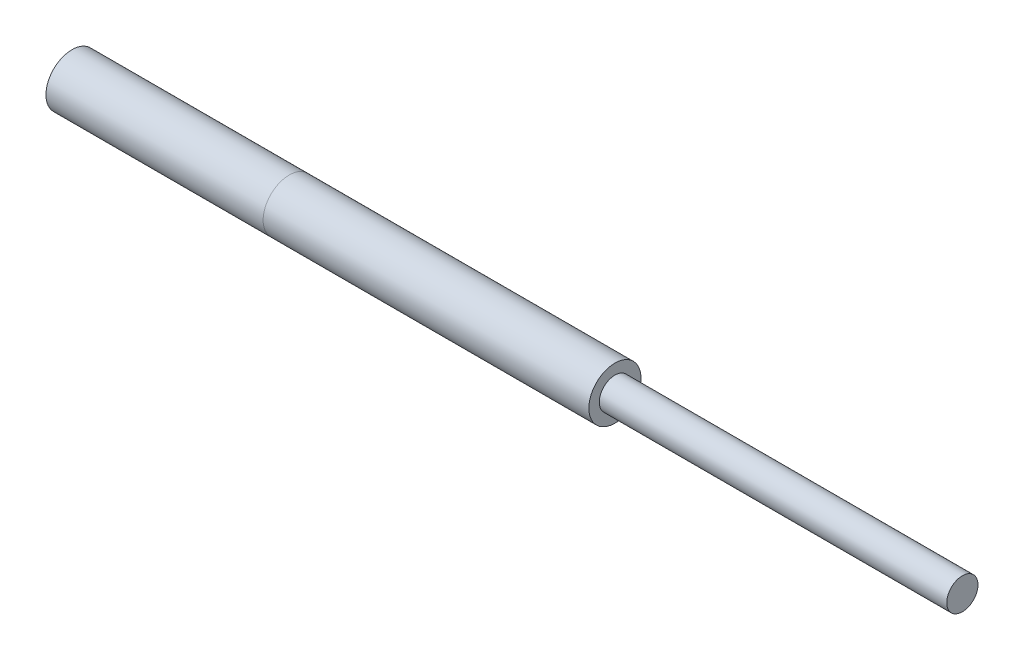
ISO-10303-21;
HEADER;
FILE_DESCRIPTION(('STEP AP214'),'2;1');
FILE_NAME('part.step','',(''),(''),'','','');
FILE_SCHEMA(('AUTOMOTIVE_DESIGN { 1 0 10303 214 1 1 1 1 }'));
ENDSEC;
DATA;
#1=APPLICATION_CONTEXT('core data for automotive mechanical design processes');
#2=APPLICATION_PROTOCOL_DEFINITION('international standard','automotive_design',2000,#1);
#3=PRODUCT_CONTEXT('',#1,'mechanical');
#4=PRODUCT('Part','Part','',(#3));
#5=PRODUCT_RELATED_PRODUCT_CATEGORY('part','',(#4));
#6=PRODUCT_DEFINITION_FORMATION('','',#4);
#7=PRODUCT_DEFINITION_CONTEXT('part definition',#1,'design');
#8=PRODUCT_DEFINITION('design','',#6,#7);
#9=PRODUCT_DEFINITION_SHAPE('','',#8);
#10=(LENGTH_UNIT() NAMED_UNIT(*) SI_UNIT(.MILLI.,.METRE.));
#11=(NAMED_UNIT(*) PLANE_ANGLE_UNIT() SI_UNIT($,.RADIAN.));
#12=(NAMED_UNIT(*) SI_UNIT($,.STERADIAN.) SOLID_ANGLE_UNIT());
#13=UNCERTAINTY_MEASURE_WITH_UNIT(LENGTH_MEASURE(1.E-05),#10,'distance_accuracy_value','');
#14=(GEOMETRIC_REPRESENTATION_CONTEXT(3) GLOBAL_UNCERTAINTY_ASSIGNED_CONTEXT((#13)) GLOBAL_UNIT_ASSIGNED_CONTEXT((#10,
#11,#12)) REPRESENTATION_CONTEXT('',''));
#15=CARTESIAN_POINT('',(0.,0.,0.));
#16=DIRECTION('',(0.,0.,1.));
#17=DIRECTION('',(1.,0.,0.));
#18=AXIS2_PLACEMENT_3D('',#15,#16,#17);
#19=CARTESIAN_POINT('',(1025.,0.,0.));
#20=DIRECTION('',(-1.,0.,0.));
#21=DIRECTION('',(0.,0.,1.));
#22=AXIS2_PLACEMENT_3D('',#19,#20,#21);
#23=CYLINDRICAL_SURFACE('',#22,18.);
#24=CARTESIAN_POINT('',(1025.,0.,0.));
#25=DIRECTION('',(1.,0.,0.));
#26=DIRECTION('',(0.,0.,-1.));
#27=AXIS2_PLACEMENT_3D('',#24,#25,#26);
#28=CIRCLE('',#27,18.);
#29=CARTESIAN_POINT('',(1025.,0.,-18.));
#30=VERTEX_POINT('',#29);
#31=EDGE_CURVE('E11',#30,#30,#28,.T.);
#32=ORIENTED_EDGE('',*,*,#31,.F.);
#33=EDGE_LOOP('',(#32));
#34=FACE_BOUND('',#33,.T.);
#35=CARTESIAN_POINT('',(625.,0.,0.));
#36=DIRECTION('',(1.,0.,0.));
#37=DIRECTION('',(0.,0.,-1.));
#38=AXIS2_PLACEMENT_3D('',#35,#36,#37);
#39=CIRCLE('',#38,18.);
#40=CARTESIAN_POINT('',(625.,0.,-18.));
#41=VERTEX_POINT('',#40);
#42=EDGE_CURVE('E48',#41,#41,#39,.T.);
#43=ORIENTED_EDGE('',*,*,#42,.T.);
#44=EDGE_LOOP('',(#43));
#45=FACE_BOUND('',#44,.T.);
#46=ADVANCED_FACE('F45',(#34,#45),#23,.T.);
#47=CARTESIAN_POINT('',(1025.,0.,0.));
#48=DIRECTION('',(1.,0.,0.));
#49=DIRECTION('',(0.,0.,-1.));
#50=AXIS2_PLACEMENT_3D('',#47,#48,#49);
#51=PLANE('',#50);
#52=ORIENTED_EDGE('',*,*,#31,.T.);
#53=EDGE_LOOP('',(#52));
#54=FACE_BOUND('',#53,.T.);
#55=ADVANCED_FACE('F60',(#54),#51,.T.);
#56=CARTESIAN_POINT('',(625.,0.,0.));
#57=DIRECTION('',(1.,0.,0.));
#58=DIRECTION('',(0.,0.,-1.));
#59=AXIS2_PLACEMENT_3D('',#56,#57,#58);
#60=PLANE('',#59);
#61=ORIENTED_EDGE('',*,*,#42,.F.);
#62=EDGE_LOOP('',(#61));
#63=FACE_BOUND('',#62,.T.);
#64=ADVANCED_FACE('F58',(#63),#60,.F.);
#65=CLOSED_SHELL('',(#46,#55,#64));
#66=MANIFOLD_SOLID_BREP('B2',#65);
#67=CARTESIAN_POINT('',(625.,0.,0.));
#68=DIRECTION('',(-1.,0.,0.));
#69=DIRECTION('',(0.,0.,1.));
#70=AXIS2_PLACEMENT_3D('',#67,#68,#69);
#71=CYLINDRICAL_SURFACE('',#70,30.);
#72=CARTESIAN_POINT('',(625.,0.,0.));
#73=DIRECTION('',(1.,0.,0.));
#74=DIRECTION('',(0.,0.,-1.));
#75=AXIS2_PLACEMENT_3D('',#72,#73,#74);
#76=CIRCLE('',#75,30.);
#77=CARTESIAN_POINT('',(625.,0.,-30.));
#78=VERTEX_POINT('',#77);
#79=EDGE_CURVE('E44',#78,#78,#76,.T.);
#80=ORIENTED_EDGE('',*,*,#79,.F.);
#81=EDGE_LOOP('',(#80));
#82=FACE_BOUND('',#81,.T.);
#83=CARTESIAN_POINT('',(250.,0.,0.));
#84=DIRECTION('',(1.,0.,0.));
#85=DIRECTION('',(0.,0.,-1.));
#86=AXIS2_PLACEMENT_3D('',#83,#84,#85);
#87=CIRCLE('',#86,30.);
#88=CARTESIAN_POINT('',(250.,0.,-30.));
#89=VERTEX_POINT('',#88);
#90=EDGE_CURVE('E95',#89,#89,#87,.T.);
#91=ORIENTED_EDGE('',*,*,#90,.T.);
#92=EDGE_LOOP('',(#91));
#93=FACE_BOUND('',#92,.T.);
#94=ADVANCED_FACE('F92',(#82,#93),#71,.T.);
#95=CARTESIAN_POINT('',(625.,0.,0.));
#96=DIRECTION('',(1.,0.,0.));
#97=DIRECTION('',(0.,0.,-1.));
#98=AXIS2_PLACEMENT_3D('',#95,#96,#97);
#99=PLANE('',#98);
#100=ORIENTED_EDGE('',*,*,#79,.T.);
#101=EDGE_LOOP('',(#100));
#102=FACE_BOUND('',#101,.T.);
#103=ADVANCED_FACE('F107',(#102),#99,.T.);
#104=CARTESIAN_POINT('',(250.,0.,0.));
#105=DIRECTION('',(1.,0.,0.));
#106=DIRECTION('',(0.,0.,-1.));
#107=AXIS2_PLACEMENT_3D('',#104,#105,#106);
#108=PLANE('',#107);
#109=ORIENTED_EDGE('',*,*,#90,.F.);
#110=EDGE_LOOP('',(#109));
#111=FACE_BOUND('',#110,.T.);
#112=ADVANCED_FACE('F105',(#111),#108,.F.);
#113=CLOSED_SHELL('',(#94,#103,#112));
#114=MANIFOLD_SOLID_BREP('B6',#113);
#115=CARTESIAN_POINT('',(250.,0.,0.));
#116=DIRECTION('',(1.,0.,0.));
#117=DIRECTION('',(0.,0.,-1.));
#118=AXIS2_PLACEMENT_3D('',#115,#116,#117);
#119=PLANE('',#118);
#120=CARTESIAN_POINT('',(250.,0.,0.));
#121=DIRECTION('',(1.,0.,0.));
#122=DIRECTION('',(0.,0.,-1.));
#123=AXIS2_PLACEMENT_3D('',#120,#121,#122);
#124=CIRCLE('',#123,30.);
#125=CARTESIAN_POINT('',(250.,0.,-30.));
#126=VERTEX_POINT('',#125);
#127=EDGE_CURVE('E91',#126,#126,#124,.T.);
#128=ORIENTED_EDGE('',*,*,#127,.T.);
#129=EDGE_LOOP('',(#128));
#130=FACE_BOUND('',#129,.T.);
#131=CARTESIAN_POINT('',(250.,0.,0.));
#132=DIRECTION('',(1.,0.,0.));
#133=DIRECTION('',(0.,0.,-1.));
#134=AXIS2_PLACEMENT_3D('',#131,#132,#133);
#135=CIRCLE('',#134,20.);
#136=CARTESIAN_POINT('',(250.,0.,-20.));
#137=VERTEX_POINT('',#136);
#138=EDGE_CURVE('E143',#137,#137,#135,.T.);
#139=ORIENTED_EDGE('',*,*,#138,.F.);
#140=EDGE_LOOP('',(#139));
#141=FACE_BOUND('',#140,.T.);
#142=ADVANCED_FACE('F132',(#130,#141),#119,.T.);
#143=CARTESIAN_POINT('',(0.,0.,0.));
#144=DIRECTION('',(1.,0.,0.));
#145=DIRECTION('',(0.,0.,-1.));
#146=AXIS2_PLACEMENT_3D('',#143,#144,#145);
#147=PLANE('',#146);
#148=CARTESIAN_POINT('',(0.,0.,0.));
#149=DIRECTION('',(1.,0.,0.));
#150=DIRECTION('',(0.,0.,-1.));
#151=AXIS2_PLACEMENT_3D('',#148,#149,#150);
#152=CIRCLE('',#151,30.);
#153=CARTESIAN_POINT('',(0.,0.,-30.));
#154=VERTEX_POINT('',#153);
#155=EDGE_CURVE('E136',#154,#154,#152,.T.);
#156=ORIENTED_EDGE('',*,*,#155,.F.);
#157=EDGE_LOOP('',(#156));
#158=FACE_BOUND('',#157,.T.);
#159=CARTESIAN_POINT('',(0.,0.,0.));
#160=DIRECTION('',(1.,0.,0.));
#161=DIRECTION('',(0.,0.,-1.));
#162=AXIS2_PLACEMENT_3D('',#159,#160,#161);
#163=CIRCLE('',#162,20.);
#164=CARTESIAN_POINT('',(0.,0.,-20.));
#165=VERTEX_POINT('',#164);
#166=EDGE_CURVE('E145',#165,#165,#163,.T.);
#167=ORIENTED_EDGE('',*,*,#166,.T.);
#168=EDGE_LOOP('',(#167));
#169=FACE_BOUND('',#168,.T.);
#170=ADVANCED_FACE('F155',(#158,#169),#147,.F.);
#171=CARTESIAN_POINT('',(250.,0.,0.));
#172=DIRECTION('',(-1.,0.,0.));
#173=DIRECTION('',(0.,0.,1.));
#174=AXIS2_PLACEMENT_3D('',#171,#172,#173);
#175=CYLINDRICAL_SURFACE('',#174,30.);
#176=ORIENTED_EDGE('',*,*,#127,.F.);
#177=EDGE_LOOP('',(#176));
#178=FACE_BOUND('',#177,.T.);
#179=ORIENTED_EDGE('',*,*,#155,.T.);
#180=EDGE_LOOP('',(#179));
#181=FACE_BOUND('',#180,.T.);
#182=ADVANCED_FACE('F134',(#178,#181),#175,.T.);
#183=CARTESIAN_POINT('',(250.,0.,0.));
#184=DIRECTION('',(-1.,0.,0.));
#185=DIRECTION('',(0.,0.,1.));
#186=AXIS2_PLACEMENT_3D('',#183,#184,#185);
#187=CYLINDRICAL_SURFACE('',#186,20.);
#188=ORIENTED_EDGE('',*,*,#138,.T.);
#189=EDGE_LOOP('',(#188));
#190=FACE_BOUND('',#189,.T.);
#191=ORIENTED_EDGE('',*,*,#166,.F.);
#192=EDGE_LOOP('',(#191));
#193=FACE_BOUND('',#192,.T.);
#194=ADVANCED_FACE('F151',(#190,#193),#187,.F.);
#195=CLOSED_SHELL('',(#142,#170,#182,#194));
#196=MANIFOLD_SOLID_BREP('B39',#195);
#197=ADVANCED_BREP_SHAPE_REPRESENTATION('',(#18,#66,#114,#196),#14);
#198=SHAPE_DEFINITION_REPRESENTATION(#9,#197);
ENDSEC;
END-ISO-10303-21;
